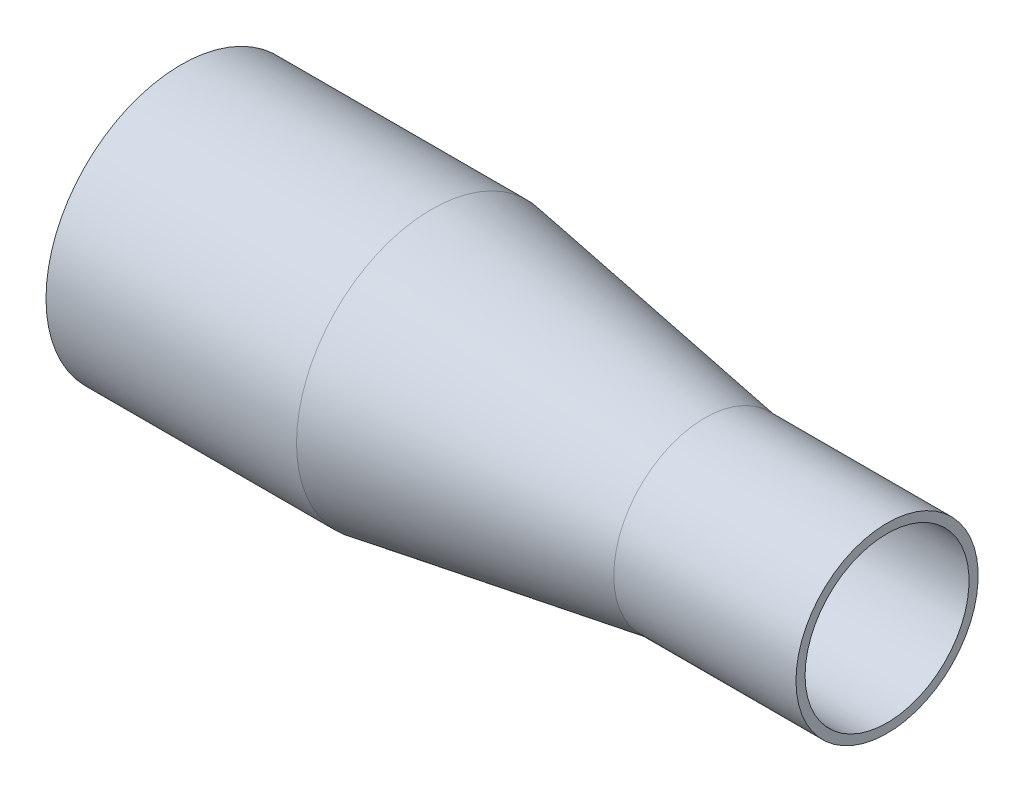
ISO-10303-21;
HEADER;
FILE_DESCRIPTION(('STEP AP214'),'2;1');
FILE_NAME('part.step','',(''),(''),'','','');
FILE_SCHEMA(('AUTOMOTIVE_DESIGN { 1 0 10303 214 1 1 1 1 }'));
ENDSEC;
DATA;
#1=APPLICATION_CONTEXT('core data for automotive mechanical design processes');
#2=APPLICATION_PROTOCOL_DEFINITION('international standard','automotive_design',2000,#1);
#3=PRODUCT_CONTEXT('',#1,'mechanical');
#4=PRODUCT('Part','Part','',(#3));
#5=PRODUCT_RELATED_PRODUCT_CATEGORY('part','',(#4));
#6=PRODUCT_DEFINITION_FORMATION('','',#4);
#7=PRODUCT_DEFINITION_CONTEXT('part definition',#1,'design');
#8=PRODUCT_DEFINITION('design','',#6,#7);
#9=PRODUCT_DEFINITION_SHAPE('','',#8);
#10=(LENGTH_UNIT() NAMED_UNIT(*) SI_UNIT(.MILLI.,.METRE.));
#11=(NAMED_UNIT(*) PLANE_ANGLE_UNIT() SI_UNIT($,.RADIAN.));
#12=(NAMED_UNIT(*) SI_UNIT($,.STERADIAN.) SOLID_ANGLE_UNIT());
#13=UNCERTAINTY_MEASURE_WITH_UNIT(LENGTH_MEASURE(1.E-05),#10,'distance_accuracy_value','');
#14=(GEOMETRIC_REPRESENTATION_CONTEXT(3) GLOBAL_UNCERTAINTY_ASSIGNED_CONTEXT((#13)) GLOBAL_UNIT_ASSIGNED_CONTEXT((#10,
#11,#12)) REPRESENTATION_CONTEXT('',''));
#15=CARTESIAN_POINT('',(0.,0.,0.));
#16=DIRECTION('',(0.,0.,1.));
#17=DIRECTION('',(1.,0.,0.));
#18=AXIS2_PLACEMENT_3D('',#15,#16,#17);
#19=CARTESIAN_POINT('',(0.,0.,0.));
#20=DIRECTION('',(1.,0.,0.));
#21=DIRECTION('',(0.,0.,-1.));
#22=AXIS2_PLACEMENT_3D('',#19,#20,#21);
#23=PLANE('',#22);
#24=CARTESIAN_POINT('',(0.,0.,0.));
#25=DIRECTION('',(1.,0.,0.));
#26=DIRECTION('',(0.,0.,-1.));
#27=AXIS2_PLACEMENT_3D('',#24,#25,#26);
#28=CIRCLE('',#27,35.1155);
#29=CARTESIAN_POINT('',(0.,0.,-35.1155));
#30=VERTEX_POINT('',#29);
#31=EDGE_CURVE('E54',#30,#30,#28,.F.);
#32=ORIENTED_EDGE('',*,*,#31,.F.);
#33=EDGE_LOOP('',(#32));
#34=FACE_BOUND('',#33,.T.);
#35=CARTESIAN_POINT('',(0.,0.,0.));
#36=DIRECTION('',(-1.,0.,0.));
#37=DIRECTION('',(0.,0.,1.));
#38=AXIS2_PLACEMENT_3D('',#35,#36,#37);
#39=CIRCLE('',#38,37.6555);
#40=CARTESIAN_POINT('',(0.,0.,37.6555));
#41=VERTEX_POINT('',#40);
#42=EDGE_CURVE('E10',#41,#41,#39,.T.);
#43=ORIENTED_EDGE('',*,*,#42,.T.);
#44=EDGE_LOOP('',(#43));
#45=FACE_BOUND('',#44,.T.);
#46=ADVANCED_FACE('F35',(#34,#45),#23,.F.);
#47=CARTESIAN_POINT('',(0.,0.,0.));
#48=DIRECTION('',(-1.,0.,0.));
#49=DIRECTION('',(0.,0.,1.));
#50=AXIS2_PLACEMENT_3D('',#47,#48,#49);
#51=CYLINDRICAL_SURFACE('',#50,37.6555);
#52=ORIENTED_EDGE('',*,*,#42,.F.);
#53=EDGE_LOOP('',(#52));
#54=FACE_BOUND('',#53,.T.);
#55=CARTESIAN_POINT('',(69.85,0.,0.));
#56=DIRECTION('',(-1.,0.,0.));
#57=DIRECTION('',(0.,0.,1.));
#58=AXIS2_PLACEMENT_3D('',#55,#56,#57);
#59=CIRCLE('',#58,37.6555);
#60=CARTESIAN_POINT('',(69.85,0.,37.6555));
#61=VERTEX_POINT('',#60);
#62=EDGE_CURVE('E41',#61,#61,#59,.T.);
#63=ORIENTED_EDGE('',*,*,#62,.T.);
#64=EDGE_LOOP('',(#63));
#65=FACE_BOUND('',#64,.T.);
#66=ADVANCED_FACE('F85',(#54,#65),#51,.T.);
#67=CARTESIAN_POINT('',(146.05,0.,0.));
#68=DIRECTION('',(-1.,0.,0.));
#69=DIRECTION('',(0.,0.,1.));
#70=AXIS2_PLACEMENT_3D('',#67,#68,#69);
#71=CONICAL_SURFACE('',#70,25.4,0.159467688889238);
#72=ORIENTED_EDGE('',*,*,#62,.F.);
#73=EDGE_LOOP('',(#72));
#74=FACE_BOUND('',#73,.T.);
#75=CARTESIAN_POINT('',(146.05,0.,0.));
#76=DIRECTION('',(-1.,0.,0.));
#77=DIRECTION('',(0.,0.,1.));
#78=AXIS2_PLACEMENT_3D('',#75,#76,#77);
#79=CIRCLE('',#78,25.4);
#80=CARTESIAN_POINT('',(146.05,0.,25.4));
#81=VERTEX_POINT('',#80);
#82=EDGE_CURVE('E45',#81,#81,#79,.T.);
#83=ORIENTED_EDGE('',*,*,#82,.T.);
#84=EDGE_LOOP('',(#83));
#85=FACE_BOUND('',#84,.T.);
#86=ADVANCED_FACE('F90',(#74,#85),#71,.T.);
#87=CARTESIAN_POINT('',(0.,0.,0.));
#88=DIRECTION('',(-1.,0.,0.));
#89=DIRECTION('',(0.,0.,1.));
#90=AXIS2_PLACEMENT_3D('',#87,#88,#89);
#91=CYLINDRICAL_SURFACE('',#90,25.4);
#92=ORIENTED_EDGE('',*,*,#82,.F.);
#93=EDGE_LOOP('',(#92));
#94=FACE_BOUND('',#93,.T.);
#95=CARTESIAN_POINT('',(196.85,0.,0.));
#96=DIRECTION('',(-1.,0.,0.));
#97=DIRECTION('',(0.,0.,1.));
#98=AXIS2_PLACEMENT_3D('',#95,#96,#97);
#99=CIRCLE('',#98,25.4);
#100=CARTESIAN_POINT('',(196.85,0.,25.4));
#101=VERTEX_POINT('',#100);
#102=EDGE_CURVE('E49',#101,#101,#99,.T.);
#103=ORIENTED_EDGE('',*,*,#102,.T.);
#104=EDGE_LOOP('',(#103));
#105=FACE_BOUND('',#104,.T.);
#106=ADVANCED_FACE('F81',(#94,#105),#91,.T.);
#107=CARTESIAN_POINT('',(196.85,0.,-25.4));
#108=DIRECTION('',(-1.,0.,0.));
#109=DIRECTION('',(0.,0.,1.));
#110=AXIS2_PLACEMENT_3D('',#107,#108,#109);
#111=PLANE('',#110);
#112=CARTESIAN_POINT('',(196.85,0.,0.));
#113=DIRECTION('',(-1.,0.,0.));
#114=DIRECTION('',(0.,0.,1.));
#115=AXIS2_PLACEMENT_3D('',#112,#113,#114);
#116=CIRCLE('',#115,22.86);
#117=CARTESIAN_POINT('',(196.85,0.,22.86));
#118=VERTEX_POINT('',#117);
#119=EDGE_CURVE('E55',#118,#118,#116,.T.);
#120=ORIENTED_EDGE('',*,*,#119,.T.);
#121=EDGE_LOOP('',(#120));
#122=FACE_BOUND('',#121,.T.);
#123=ORIENTED_EDGE('',*,*,#102,.F.);
#124=EDGE_LOOP('',(#123));
#125=FACE_BOUND('',#124,.T.);
#126=ADVANCED_FACE('F72',(#122,#125),#111,.F.);
#127=CARTESIAN_POINT('',(0.,0.,0.));
#128=DIRECTION('',(-1.,0.,0.));
#129=DIRECTION('',(0.,0.,1.));
#130=AXIS2_PLACEMENT_3D('',#127,#128,#129);
#131=CYLINDRICAL_SURFACE('',#130,35.1155);
#132=ORIENTED_EDGE('',*,*,#31,.T.);
#133=EDGE_LOOP('',(#132));
#134=FACE_BOUND('',#133,.T.);
#135=CARTESIAN_POINT('',(69.6470457598027,0.,0.));
#136=DIRECTION('',(-1.,0.,0.));
#137=DIRECTION('',(0.,0.,1.));
#138=AXIS2_PLACEMENT_3D('',#135,#136,#137);
#139=CIRCLE('',#138,35.1155);
#140=CARTESIAN_POINT('',(69.6470457598027,0.,35.1155));
#141=VERTEX_POINT('',#140);
#142=EDGE_CURVE('E61',#141,#141,#139,.T.);
#143=ORIENTED_EDGE('',*,*,#142,.F.);
#144=EDGE_LOOP('',(#143));
#145=FACE_BOUND('',#144,.T.);
#146=ADVANCED_FACE('F70',(#134,#145),#131,.F.);
#147=CARTESIAN_POINT('',(145.646666613081,0.,0.));
#148=DIRECTION('',(-1.,0.,0.));
#149=DIRECTION('',(0.,0.,1.));
#150=AXIS2_PLACEMENT_3D('',#147,#148,#149);
#151=CONICAL_SURFACE('',#150,22.8922276460978,0.159467688889238);
#152=ORIENTED_EDGE('',*,*,#142,.T.);
#153=EDGE_LOOP('',(#152));
#154=FACE_BOUND('',#153,.T.);
#155=CARTESIAN_POINT('',(145.847045759803,0.,0.));
#156=DIRECTION('',(-1.,0.,0.));
#157=DIRECTION('',(0.,0.,1.));
#158=AXIS2_PLACEMENT_3D('',#155,#156,#157);
#159=CIRCLE('',#158,22.86);
#160=CARTESIAN_POINT('',(145.847045759803,0.,22.86));
#161=VERTEX_POINT('',#160);
#162=EDGE_CURVE('E58',#161,#161,#159,.T.);
#163=ORIENTED_EDGE('',*,*,#162,.F.);
#164=EDGE_LOOP('',(#163));
#165=FACE_BOUND('',#164,.T.);
#166=ADVANCED_FACE('F67',(#154,#165),#151,.F.);
#167=CARTESIAN_POINT('',(0.,0.,0.));
#168=DIRECTION('',(-1.,0.,0.));
#169=DIRECTION('',(0.,0.,1.));
#170=AXIS2_PLACEMENT_3D('',#167,#168,#169);
#171=CYLINDRICAL_SURFACE('',#170,22.86);
#172=ORIENTED_EDGE('',*,*,#162,.T.);
#173=EDGE_LOOP('',(#172));
#174=FACE_BOUND('',#173,.T.);
#175=ORIENTED_EDGE('',*,*,#119,.F.);
#176=EDGE_LOOP('',(#175));
#177=FACE_BOUND('',#176,.T.);
#178=ADVANCED_FACE('F79',(#174,#177),#171,.F.);
#179=CLOSED_SHELL('',(#46,#66,#86,#106,#126,#146,#166,#178));
#180=MANIFOLD_SOLID_BREP('B2',#179);
#181=ADVANCED_BREP_SHAPE_REPRESENTATION('',(#18,#180),#14);
#182=SHAPE_DEFINITION_REPRESENTATION(#9,#181);
ENDSEC;
END-ISO-10303-21;
